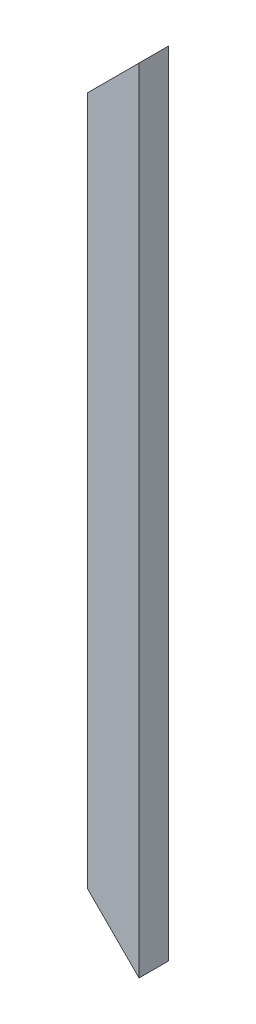
ISO-10303-21;
HEADER;
FILE_DESCRIPTION(('STEP AP214'),'2;1');
FILE_NAME('part.step','',(''),(''),'','','');
FILE_SCHEMA(('AUTOMOTIVE_DESIGN { 1 0 10303 214 1 1 1 1 }'));
ENDSEC;
DATA;
#1=APPLICATION_CONTEXT('core data for automotive mechanical design processes');
#2=APPLICATION_PROTOCOL_DEFINITION('international standard','automotive_design',2000,#1);
#3=PRODUCT_CONTEXT('',#1,'mechanical');
#4=PRODUCT('Part','Part','',(#3));
#5=PRODUCT_RELATED_PRODUCT_CATEGORY('part','',(#4));
#6=PRODUCT_DEFINITION_FORMATION('','',#4);
#7=PRODUCT_DEFINITION_CONTEXT('part definition',#1,'design');
#8=PRODUCT_DEFINITION('design','',#6,#7);
#9=PRODUCT_DEFINITION_SHAPE('','',#8);
#10=(LENGTH_UNIT() NAMED_UNIT(*) SI_UNIT(.MILLI.,.METRE.));
#11=(NAMED_UNIT(*) PLANE_ANGLE_UNIT() SI_UNIT($,.RADIAN.));
#12=(NAMED_UNIT(*) SI_UNIT($,.STERADIAN.) SOLID_ANGLE_UNIT());
#13=UNCERTAINTY_MEASURE_WITH_UNIT(LENGTH_MEASURE(1.E-05),#10,'distance_accuracy_value','');
#14=(GEOMETRIC_REPRESENTATION_CONTEXT(3) GLOBAL_UNCERTAINTY_ASSIGNED_CONTEXT((#13)) GLOBAL_UNIT_ASSIGNED_CONTEXT((#10,
#11,#12)) REPRESENTATION_CONTEXT('',''));
#15=CARTESIAN_POINT('',(0.,0.,0.));
#16=DIRECTION('',(0.,0.,1.));
#17=DIRECTION('',(1.,0.,0.));
#18=AXIS2_PLACEMENT_3D('',#15,#16,#17);
#19=CARTESIAN_POINT('',(44.45,0.,0.));
#20=DIRECTION('',(0.,0.,-1.));
#21=DIRECTION('',(-1.,0.,0.));
#22=AXIS2_PLACEMENT_3D('',#19,#20,#21);
#23=PLANE('',#22);
#24=DIRECTION('',(0.,-1.,0.));
#25=VECTOR('',#24,1.);
#26=CARTESIAN_POINT('',(44.45,0.,0.));
#27=LINE('',#26,#25);
#28=CARTESIAN_POINT('',(44.45,682.499465201256,0.));
#29=VERTEX_POINT('',#28);
#30=CARTESIAN_POINT('',(44.45,0.,0.));
#31=VERTEX_POINT('',#30);
#32=EDGE_CURVE('E86',#29,#31,#27,.T.);
#33=ORIENTED_EDGE('',*,*,#32,.F.);
#34=DIRECTION('',(0.707106781186551,0.707106781186544,0.));
#35=VECTOR('',#34,1.);
#36=CARTESIAN_POINT('',(0.,638.049465201256,0.));
#37=LINE('',#36,#35);
#38=CARTESIAN_POINT('',(0.,638.049465201256,0.));
#39=VERTEX_POINT('',#38);
#40=EDGE_CURVE('E79',#39,#29,#37,.T.);
#41=ORIENTED_EDGE('',*,*,#40,.F.);
#42=DIRECTION('',(0.,-1.,0.));
#43=VECTOR('',#42,1.);
#44=CARTESIAN_POINT('',(0.,0.,0.));
#45=LINE('',#44,#43);
#46=CARTESIAN_POINT('',(0.,44.4500000000004,0.));
#47=VERTEX_POINT('',#46);
#48=EDGE_CURVE('E61',#39,#47,#45,.T.);
#49=ORIENTED_EDGE('',*,*,#48,.T.);
#50=DIRECTION('',(-0.707106781186544,0.707106781186551,0.));
#51=VECTOR('',#50,1.);
#52=CARTESIAN_POINT('',(44.45,0.,0.));
#53=LINE('',#52,#51);
#54=EDGE_CURVE('E99',#31,#47,#53,.T.);
#55=ORIENTED_EDGE('',*,*,#54,.F.);
#56=EDGE_LOOP('',(#33,#41,#49,#55));
#57=FACE_BOUND('',#56,.T.);
#58=ADVANCED_FACE('F39',(#57),#23,.F.);
#59=CARTESIAN_POINT('',(44.45,0.,-25.4));
#60=DIRECTION('',(0.,0.,1.));
#61=DIRECTION('',(1.,0.,0.));
#62=AXIS2_PLACEMENT_3D('',#59,#60,#61);
#63=PLANE('',#62);
#64=DIRECTION('',(0.,1.,0.));
#65=VECTOR('',#64,1.);
#66=CARTESIAN_POINT('',(0.,0.,-25.4));
#67=LINE('',#66,#65);
#68=CARTESIAN_POINT('',(0.,44.4500000000004,-25.4));
#69=VERTEX_POINT('',#68);
#70=CARTESIAN_POINT('',(0.,638.049465201256,-25.4));
#71=VERTEX_POINT('',#70);
#72=EDGE_CURVE('E92',#69,#71,#67,.T.);
#73=ORIENTED_EDGE('',*,*,#72,.T.);
#74=DIRECTION('',(0.707106781186551,0.707106781186544,0.));
#75=VECTOR('',#74,1.);
#76=CARTESIAN_POINT('',(-296.799732600628,341.249732600631,-25.4));
#77=LINE('',#76,#75);
#78=CARTESIAN_POINT('',(44.45,682.499465201256,-25.4));
#79=VERTEX_POINT('',#78);
#80=EDGE_CURVE('E53',#71,#79,#77,.T.);
#81=ORIENTED_EDGE('',*,*,#80,.T.);
#82=DIRECTION('',(0.,1.,0.));
#83=VECTOR('',#82,1.);
#84=CARTESIAN_POINT('',(44.45,0.,-25.4));
#85=LINE('',#84,#83);
#86=CARTESIAN_POINT('',(44.45,0.,-25.4));
#87=VERTEX_POINT('',#86);
#88=EDGE_CURVE('E107',#87,#79,#85,.T.);
#89=ORIENTED_EDGE('',*,*,#88,.F.);
#90=DIRECTION('',(-0.707106781186544,0.707106781186551,0.));
#91=VECTOR('',#90,1.);
#92=CARTESIAN_POINT('',(44.45,0.,-25.4));
#93=LINE('',#92,#91);
#94=EDGE_CURVE('E93',#87,#69,#93,.T.);
#95=ORIENTED_EDGE('',*,*,#94,.T.);
#96=EDGE_LOOP('',(#73,#81,#89,#95));
#97=FACE_BOUND('',#96,.T.);
#98=ADVANCED_FACE('F123',(#97),#63,.F.);
#99=CARTESIAN_POINT('',(44.45,0.,0.));
#100=DIRECTION('',(-1.,0.,0.));
#101=DIRECTION('',(0.,0.,1.));
#102=AXIS2_PLACEMENT_3D('',#99,#100,#101);
#103=PLANE('',#102);
#104=ORIENTED_EDGE('',*,*,#32,.T.);
#105=DIRECTION('',(0.,0.,-1.));
#106=VECTOR('',#105,1.);
#107=CARTESIAN_POINT('',(44.45,0.,0.));
#108=LINE('',#107,#106);
#109=EDGE_CURVE('E111',#31,#87,#108,.T.);
#110=ORIENTED_EDGE('',*,*,#109,.T.);
#111=ORIENTED_EDGE('',*,*,#88,.T.);
#112=DIRECTION('',(0.,0.,1.));
#113=VECTOR('',#112,1.);
#114=CARTESIAN_POINT('',(44.45,682.499465201256,0.));
#115=LINE('',#114,#113);
#116=EDGE_CURVE('E102',#79,#29,#115,.T.);
#117=ORIENTED_EDGE('',*,*,#116,.T.);
#118=EDGE_LOOP('',(#104,#110,#111,#117));
#119=FACE_BOUND('',#118,.T.);
#120=ADVANCED_FACE('F125',(#119),#103,.F.);
#121=CARTESIAN_POINT('',(0.,0.,0.));
#122=DIRECTION('',(-1.,0.,0.));
#123=DIRECTION('',(0.,0.,1.));
#124=AXIS2_PLACEMENT_3D('',#121,#122,#123);
#125=PLANE('',#124);
#126=DIRECTION('',(0.,0.,1.));
#127=VECTOR('',#126,1.);
#128=CARTESIAN_POINT('',(0.,638.049465201256,0.));
#129=LINE('',#128,#127);
#130=EDGE_CURVE('E11',#71,#39,#129,.T.);
#131=ORIENTED_EDGE('',*,*,#130,.F.);
#132=ORIENTED_EDGE('',*,*,#72,.F.);
#133=DIRECTION('',(0.,0.,-1.));
#134=VECTOR('',#133,1.);
#135=CARTESIAN_POINT('',(0.,44.4500000000004,0.));
#136=LINE('',#135,#134);
#137=EDGE_CURVE('E47',#47,#69,#136,.T.);
#138=ORIENTED_EDGE('',*,*,#137,.F.);
#139=ORIENTED_EDGE('',*,*,#48,.F.);
#140=EDGE_LOOP('',(#131,#132,#138,#139));
#141=FACE_BOUND('',#140,.T.);
#142=ADVANCED_FACE('F90',(#141),#125,.T.);
#143=CARTESIAN_POINT('',(44.45,0.,-44.45));
#144=DIRECTION('',(0.707106781186551,0.707106781186544,0.));
#145=DIRECTION('',(-0.707106781186544,0.707106781186551,0.));
#146=AXIS2_PLACEMENT_3D('',#143,#144,#145);
#147=PLANE('',#146);
#148=ORIENTED_EDGE('',*,*,#109,.F.);
#149=ORIENTED_EDGE('',*,*,#54,.T.);
#150=ORIENTED_EDGE('',*,*,#137,.T.);
#151=ORIENTED_EDGE('',*,*,#94,.F.);
#152=EDGE_LOOP('',(#148,#149,#150,#151));
#153=FACE_BOUND('',#152,.T.);
#154=ADVANCED_FACE('F124',(#153),#147,.F.);
#155=CARTESIAN_POINT('',(0.,638.049465201256,-44.45));
#156=DIRECTION('',(0.707106781186544,-0.707106781186551,0.));
#157=DIRECTION('',(0.707106781186551,0.707106781186544,0.));
#158=AXIS2_PLACEMENT_3D('',#155,#156,#157);
#159=PLANE('',#158);
#160=ORIENTED_EDGE('',*,*,#130,.T.);
#161=ORIENTED_EDGE('',*,*,#40,.T.);
#162=ORIENTED_EDGE('',*,*,#116,.F.);
#163=ORIENTED_EDGE('',*,*,#80,.F.);
#164=EDGE_LOOP('',(#160,#161,#162,#163));
#165=FACE_BOUND('',#164,.T.);
#166=ADVANCED_FACE('F78',(#165),#159,.F.);
#167=CLOSED_SHELL('',(#58,#98,#120,#142,#154,#166));
#168=MANIFOLD_SOLID_BREP('B2',#167);
#169=ADVANCED_BREP_SHAPE_REPRESENTATION('',(#18,#168),#14);
#170=SHAPE_DEFINITION_REPRESENTATION(#9,#169);
ENDSEC;
END-ISO-10303-21;
